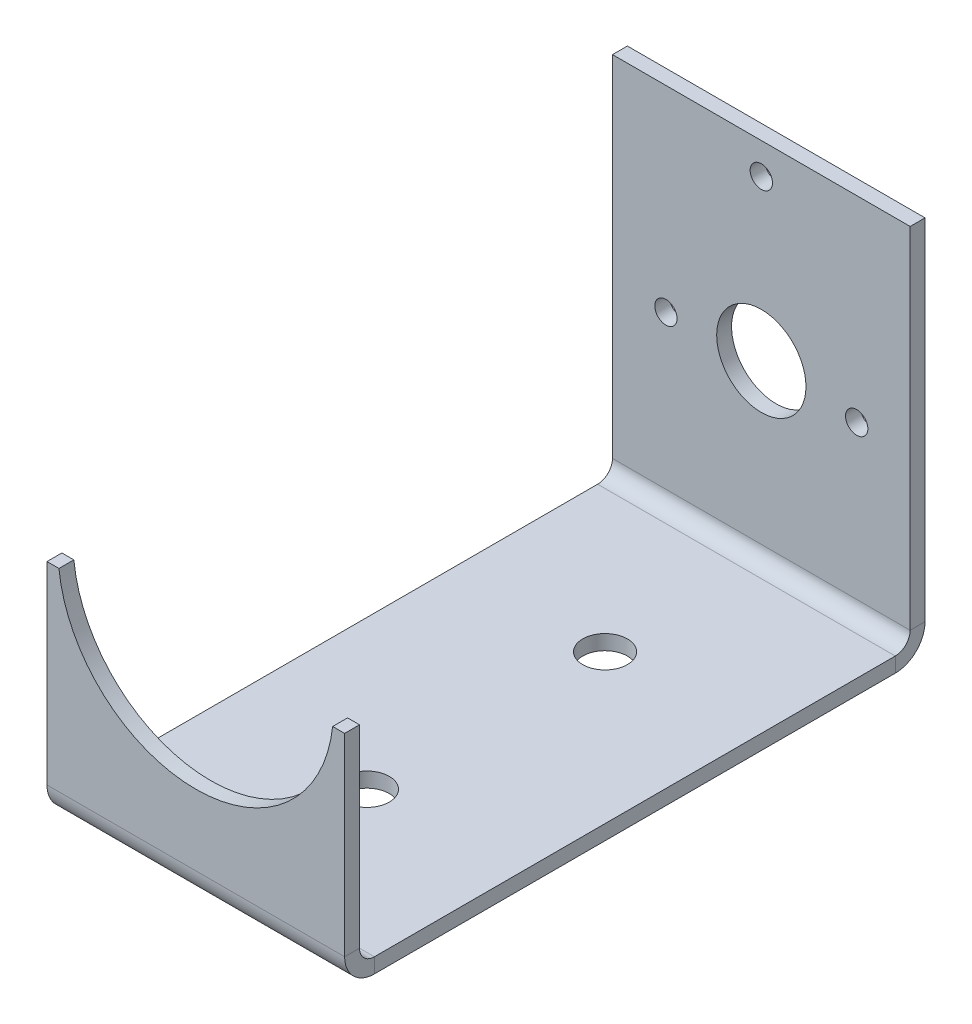
ISO-10303-21;
HEADER;
FILE_DESCRIPTION(('STEP AP214'),'2;1');
FILE_NAME('part.step','',(''),(''),'','','');
FILE_SCHEMA(('AUTOMOTIVE_DESIGN { 1 0 10303 214 1 1 1 1 }'));
ENDSEC;
DATA;
#1=APPLICATION_CONTEXT('core data for automotive mechanical design processes');
#2=APPLICATION_PROTOCOL_DEFINITION('international standard','automotive_design',2000,#1);
#3=PRODUCT_CONTEXT('',#1,'mechanical');
#4=PRODUCT('Part','Part','',(#3));
#5=PRODUCT_RELATED_PRODUCT_CATEGORY('part','',(#4));
#6=PRODUCT_DEFINITION_FORMATION('','',#4);
#7=PRODUCT_DEFINITION_CONTEXT('part definition',#1,'design');
#8=PRODUCT_DEFINITION('design','',#6,#7);
#9=PRODUCT_DEFINITION_SHAPE('','',#8);
#10=(LENGTH_UNIT() NAMED_UNIT(*) SI_UNIT(.MILLI.,.METRE.));
#11=(NAMED_UNIT(*) PLANE_ANGLE_UNIT() SI_UNIT($,.RADIAN.));
#12=(NAMED_UNIT(*) SI_UNIT($,.STERADIAN.) SOLID_ANGLE_UNIT());
#13=UNCERTAINTY_MEASURE_WITH_UNIT(LENGTH_MEASURE(1.E-05),#10,'distance_accuracy_value','');
#14=(GEOMETRIC_REPRESENTATION_CONTEXT(3) GLOBAL_UNCERTAINTY_ASSIGNED_CONTEXT((#13)) GLOBAL_UNIT_ASSIGNED_CONTEXT((#10,
#11,#12)) REPRESENTATION_CONTEXT('',''));
#15=CARTESIAN_POINT('',(0.,0.,0.));
#16=DIRECTION('',(0.,0.,1.));
#17=DIRECTION('',(1.,0.,0.));
#18=AXIS2_PLACEMENT_3D('',#15,#16,#17);
#19=CARTESIAN_POINT('',(-20.,30.,39.));
#20=DIRECTION('',(0.,-1.,0.));
#21=DIRECTION('',(0.,0.,-1.));
#22=AXIS2_PLACEMENT_3D('',#19,#20,#21);
#23=PLANE('',#22);
#24=DIRECTION('',(-1.,0.,0.));
#25=VECTOR('',#24,1.);
#26=CARTESIAN_POINT('',(0.,30.,39.));
#27=LINE('',#26,#25);
#28=CARTESIAN_POINT('',(-18.3915741576464,30.,39.));
#29=VERTEX_POINT('',#28);
#30=CARTESIAN_POINT('',(-20.,30.,39.));
#31=VERTEX_POINT('',#30);
#32=EDGE_CURVE('E255',#29,#31,#27,.T.);
#33=ORIENTED_EDGE('',*,*,#32,.F.);
#34=DIRECTION('',(0.,0.,-1.));
#35=VECTOR('',#34,1.);
#36=CARTESIAN_POINT('',(-18.3915741576464,30.,54.9999999999999));
#37=LINE('',#36,#35);
#38=CARTESIAN_POINT('',(-18.3915741576464,30.,37.));
#39=VERTEX_POINT('',#38);
#40=EDGE_CURVE('E15',#29,#39,#37,.T.);
#41=ORIENTED_EDGE('',*,*,#40,.T.);
#42=DIRECTION('',(1.,0.,0.));
#43=VECTOR('',#42,1.);
#44=CARTESIAN_POINT('',(-20.,30.,37.));
#45=LINE('',#44,#43);
#46=CARTESIAN_POINT('',(-20.,30.,37.));
#47=VERTEX_POINT('',#46);
#48=EDGE_CURVE('E267',#39,#47,#45,.F.);
#49=ORIENTED_EDGE('',*,*,#48,.T.);
#50=DIRECTION('',(0.,0.,-1.));
#51=VECTOR('',#50,1.);
#52=CARTESIAN_POINT('',(-20.,30.,39.));
#53=LINE('',#52,#51);
#54=EDGE_CURVE('E254',#31,#47,#53,.T.);
#55=ORIENTED_EDGE('',*,*,#54,.F.);
#56=EDGE_LOOP('',(#33,#41,#49,#55));
#57=FACE_BOUND('',#56,.T.);
#58=ADVANCED_FACE('F92',(#57),#23,.F.);
#59=CARTESIAN_POINT('',(-20.,2.,-35.));
#60=DIRECTION('',(-1.,0.,0.));
#61=DIRECTION('',(0.,0.,1.));
#62=AXIS2_PLACEMENT_3D('',#59,#60,#61);
#63=PLANE('',#62);
#64=DIRECTION('',(0.,1.,0.));
#65=VECTOR('',#64,1.);
#66=CARTESIAN_POINT('',(-20.,2.,-35.));
#67=LINE('',#66,#65);
#68=CARTESIAN_POINT('',(-20.,0.,-35.));
#69=VERTEX_POINT('',#68);
#70=CARTESIAN_POINT('',(-20.,2.,-35.));
#71=VERTEX_POINT('',#70);
#72=EDGE_CURVE('E167',#69,#71,#67,.T.);
#73=ORIENTED_EDGE('',*,*,#72,.F.);
#74=DIRECTION('',(0.,0.,1.));
#75=VECTOR('',#74,1.);
#76=CARTESIAN_POINT('',(-20.,0.,0.));
#77=LINE('',#76,#75);
#78=CARTESIAN_POINT('',(-20.,0.,35.));
#79=VERTEX_POINT('',#78);
#80=EDGE_CURVE('E138',#69,#79,#77,.T.);
#81=ORIENTED_EDGE('',*,*,#80,.T.);
#82=DIRECTION('',(0.,1.,0.));
#83=VECTOR('',#82,1.);
#84=CARTESIAN_POINT('',(-20.,2.,35.));
#85=LINE('',#84,#83);
#86=CARTESIAN_POINT('',(-20.,2.,35.));
#87=VERTEX_POINT('',#86);
#88=EDGE_CURVE('E169',#79,#87,#85,.T.);
#89=ORIENTED_EDGE('',*,*,#88,.T.);
#90=DIRECTION('',(0.,0.,1.));
#91=VECTOR('',#90,1.);
#92=CARTESIAN_POINT('',(-20.,2.,-35.));
#93=LINE('',#92,#91);
#94=EDGE_CURVE('E158',#71,#87,#93,.T.);
#95=ORIENTED_EDGE('',*,*,#94,.F.);
#96=EDGE_LOOP('',(#73,#81,#89,#95));
#97=FACE_BOUND('',#96,.T.);
#98=ADVANCED_FACE('F94',(#97),#63,.T.);
#99=CARTESIAN_POINT('',(20.,2.,-35.));
#100=DIRECTION('',(1.,0.,0.));
#101=DIRECTION('',(0.,0.,-1.));
#102=AXIS2_PLACEMENT_3D('',#99,#100,#101);
#103=PLANE('',#102);
#104=DIRECTION('',(0.,1.,0.));
#105=VECTOR('',#104,1.);
#106=CARTESIAN_POINT('',(20.,2.,35.));
#107=LINE('',#106,#105);
#108=CARTESIAN_POINT('',(20.,0.,35.));
#109=VERTEX_POINT('',#108);
#110=CARTESIAN_POINT('',(20.,2.,35.));
#111=VERTEX_POINT('',#110);
#112=EDGE_CURVE('E205',#109,#111,#107,.T.);
#113=ORIENTED_EDGE('',*,*,#112,.F.);
#114=DIRECTION('',(0.,0.,1.));
#115=VECTOR('',#114,1.);
#116=CARTESIAN_POINT('',(20.,0.,0.));
#117=LINE('',#116,#115);
#118=CARTESIAN_POINT('',(20.,0.,-35.));
#119=VERTEX_POINT('',#118);
#120=EDGE_CURVE('E198',#109,#119,#117,.F.);
#121=ORIENTED_EDGE('',*,*,#120,.T.);
#122=DIRECTION('',(0.,1.,0.));
#123=VECTOR('',#122,1.);
#124=CARTESIAN_POINT('',(20.,2.,-35.));
#125=LINE('',#124,#123);
#126=CARTESIAN_POINT('',(20.,2.,-35.));
#127=VERTEX_POINT('',#126);
#128=EDGE_CURVE('E197',#119,#127,#125,.T.);
#129=ORIENTED_EDGE('',*,*,#128,.T.);
#130=DIRECTION('',(0.,0.,-1.));
#131=VECTOR('',#130,1.);
#132=CARTESIAN_POINT('',(20.,2.,-35.));
#133=LINE('',#132,#131);
#134=EDGE_CURVE('E116',#111,#127,#133,.T.);
#135=ORIENTED_EDGE('',*,*,#134,.F.);
#136=EDGE_LOOP('',(#113,#121,#129,#135));
#137=FACE_BOUND('',#136,.T.);
#138=ADVANCED_FACE('F427',(#137),#103,.T.);
#139=CARTESIAN_POINT('',(0.,2.,0.));
#140=DIRECTION('',(0.,1.,0.));
#141=DIRECTION('',(0.,0.,1.));
#142=AXIS2_PLACEMENT_3D('',#139,#140,#141);
#143=PLANE('',#142);
#144=CARTESIAN_POINT('',(0.,2.,-16.));
#145=DIRECTION('',(0.,1.,0.));
#146=DIRECTION('',(0.,0.,1.));
#147=AXIS2_PLACEMENT_3D('',#144,#145,#146);
#148=CIRCLE('',#147,3.);
#149=CARTESIAN_POINT('',(0.,2.,-13.));
#150=VERTEX_POINT('',#149);
#151=EDGE_CURVE('E228',#150,#150,#148,.T.);
#152=ORIENTED_EDGE('',*,*,#151,.F.);
#153=EDGE_LOOP('',(#152));
#154=FACE_BOUND('',#153,.T.);
#155=CARTESIAN_POINT('',(0.,2.,16.));
#156=DIRECTION('',(0.,1.,0.));
#157=DIRECTION('',(0.,0.,1.));
#158=AXIS2_PLACEMENT_3D('',#155,#156,#157);
#159=CIRCLE('',#158,3.);
#160=CARTESIAN_POINT('',(0.,2.,19.));
#161=VERTEX_POINT('',#160);
#162=EDGE_CURVE('E289',#161,#161,#159,.T.);
#163=ORIENTED_EDGE('',*,*,#162,.F.);
#164=EDGE_LOOP('',(#163));
#165=FACE_BOUND('',#164,.T.);
#166=ORIENTED_EDGE('',*,*,#134,.T.);
#167=DIRECTION('',(-1.,0.,0.));
#168=VECTOR('',#167,1.);
#169=CARTESIAN_POINT('',(-20.,2.,-35.));
#170=LINE('',#169,#168);
#171=EDGE_CURVE('E155',#127,#71,#170,.T.);
#172=ORIENTED_EDGE('',*,*,#171,.T.);
#173=ORIENTED_EDGE('',*,*,#94,.T.);
#174=DIRECTION('',(1.,0.,0.));
#175=VECTOR('',#174,1.);
#176=CARTESIAN_POINT('',(-20.,2.,35.));
#177=LINE('',#176,#175);
#178=EDGE_CURVE('E170',#87,#111,#177,.T.);
#179=ORIENTED_EDGE('',*,*,#178,.T.);
#180=EDGE_LOOP('',(#166,#172,#173,#179));
#181=FACE_BOUND('',#180,.T.);
#182=ADVANCED_FACE('F157',(#154,#165,#181),#143,.T.);
#183=CARTESIAN_POINT('',(0.,0.,0.));
#184=DIRECTION('',(0.,1.,0.));
#185=DIRECTION('',(0.,0.,1.));
#186=AXIS2_PLACEMENT_3D('',#183,#184,#185);
#187=PLANE('',#186);
#188=CARTESIAN_POINT('',(0.,0.,-16.));
#189=DIRECTION('',(0.,1.,0.));
#190=DIRECTION('',(0.,0.,1.));
#191=AXIS2_PLACEMENT_3D('',#188,#189,#190);
#192=CIRCLE('',#191,3.);
#193=CARTESIAN_POINT('',(0.,0.,-13.));
#194=VERTEX_POINT('',#193);
#195=EDGE_CURVE('E227',#194,#194,#192,.T.);
#196=ORIENTED_EDGE('',*,*,#195,.T.);
#197=EDGE_LOOP('',(#196));
#198=FACE_BOUND('',#197,.T.);
#199=CARTESIAN_POINT('',(0.,0.,16.));
#200=DIRECTION('',(0.,1.,0.));
#201=DIRECTION('',(0.,0.,1.));
#202=AXIS2_PLACEMENT_3D('',#199,#200,#201);
#203=CIRCLE('',#202,3.);
#204=CARTESIAN_POINT('',(0.,0.,19.));
#205=VERTEX_POINT('',#204);
#206=EDGE_CURVE('E224',#205,#205,#203,.T.);
#207=ORIENTED_EDGE('',*,*,#206,.T.);
#208=EDGE_LOOP('',(#207));
#209=FACE_BOUND('',#208,.T.);
#210=ORIENTED_EDGE('',*,*,#120,.F.);
#211=DIRECTION('',(1.,0.,0.));
#212=VECTOR('',#211,1.);
#213=CARTESIAN_POINT('',(0.,0.,35.));
#214=LINE('',#213,#212);
#215=EDGE_CURVE('E194',#79,#109,#214,.T.);
#216=ORIENTED_EDGE('',*,*,#215,.F.);
#217=ORIENTED_EDGE('',*,*,#80,.F.);
#218=DIRECTION('',(1.,0.,0.));
#219=VECTOR('',#218,1.);
#220=CARTESIAN_POINT('',(0.,0.,-35.));
#221=LINE('',#220,#219);
#222=EDGE_CURVE('E133',#119,#69,#221,.F.);
#223=ORIENTED_EDGE('',*,*,#222,.F.);
#224=EDGE_LOOP('',(#210,#216,#217,#223));
#225=FACE_BOUND('',#224,.T.);
#226=ADVANCED_FACE('F426',(#198,#209,#225),#187,.F.);
#227=CARTESIAN_POINT('',(20.,3.99999999999998,-35.));
#228=DIRECTION('',(1.,0.,0.));
#229=DIRECTION('',(0.,0.,-1.));
#230=AXIS2_PLACEMENT_3D('',#227,#228,#229);
#231=PLANE('',#230);
#232=DIRECTION('',(0.,0.,1.));
#233=VECTOR('',#232,1.);
#234=CARTESIAN_POINT('',(20.,4.00000000000001,-39.));
#235=LINE('',#234,#233);
#236=CARTESIAN_POINT('',(20.,3.99999999999998,-37.));
#237=VERTEX_POINT('',#236);
#238=CARTESIAN_POINT('',(20.,3.99999999999997,-39.));
#239=VERTEX_POINT('',#238);
#240=EDGE_CURVE('E223',#237,#239,#235,.F.);
#241=ORIENTED_EDGE('',*,*,#240,.F.);
#242=CARTESIAN_POINT('',(20.,3.99999999999998,-35.));
#243=DIRECTION('',(-1.,0.,0.));
#244=DIRECTION('',(0.,0.,1.));
#245=AXIS2_PLACEMENT_3D('',#242,#243,#244);
#246=CIRCLE('',#245,2.);
#247=EDGE_CURVE('E185',#127,#237,#246,.F.);
#248=ORIENTED_EDGE('',*,*,#247,.F.);
#249=ORIENTED_EDGE('',*,*,#128,.F.);
#250=CARTESIAN_POINT('',(20.,3.99999999999998,-35.));
#251=DIRECTION('',(-1.,0.,0.));
#252=DIRECTION('',(0.,0.,1.));
#253=AXIS2_PLACEMENT_3D('',#250,#251,#252);
#254=CIRCLE('',#253,4.);
#255=EDGE_CURVE('E200',#119,#239,#254,.F.);
#256=ORIENTED_EDGE('',*,*,#255,.T.);
#257=EDGE_LOOP('',(#241,#248,#249,#256));
#258=FACE_BOUND('',#257,.T.);
#259=ADVANCED_FACE('F344',(#258),#231,.T.);
#260=CARTESIAN_POINT('',(-20.,3.99999999999998,-35.));
#261=DIRECTION('',(1.,0.,0.));
#262=DIRECTION('',(0.,0.,-1.));
#263=AXIS2_PLACEMENT_3D('',#260,#261,#262);
#264=PLANE('',#263);
#265=CARTESIAN_POINT('',(-20.,3.99999999999998,-35.));
#266=DIRECTION('',(-1.,0.,0.));
#267=DIRECTION('',(0.,0.,1.));
#268=AXIS2_PLACEMENT_3D('',#265,#266,#267);
#269=CIRCLE('',#268,2.);
#270=CARTESIAN_POINT('',(-20.,3.99999999999998,-37.));
#271=VERTEX_POINT('',#270);
#272=EDGE_CURVE('E177',#271,#71,#269,.T.);
#273=ORIENTED_EDGE('',*,*,#272,.F.);
#274=DIRECTION('',(0.,0.,1.));
#275=VECTOR('',#274,1.);
#276=CARTESIAN_POINT('',(-20.,4.,-37.));
#277=LINE('',#276,#275);
#278=CARTESIAN_POINT('',(-20.,4.00000000000001,-39.));
#279=VERTEX_POINT('',#278);
#280=EDGE_CURVE('E335',#271,#279,#277,.F.);
#281=ORIENTED_EDGE('',*,*,#280,.T.);
#282=CARTESIAN_POINT('',(-20.,3.99999999999998,-35.));
#283=DIRECTION('',(-1.,0.,0.));
#284=DIRECTION('',(0.,0.,1.));
#285=AXIS2_PLACEMENT_3D('',#282,#283,#284);
#286=CIRCLE('',#285,4.);
#287=EDGE_CURVE('E180',#279,#69,#286,.T.);
#288=ORIENTED_EDGE('',*,*,#287,.T.);
#289=ORIENTED_EDGE('',*,*,#72,.T.);
#290=EDGE_LOOP('',(#273,#281,#288,#289));
#291=FACE_BOUND('',#290,.T.);
#292=ADVANCED_FACE('F175',(#291),#264,.F.);
#293=CARTESIAN_POINT('',(-20.,3.99999999999998,-35.));
#294=DIRECTION('',(-1.,0.,0.));
#295=DIRECTION('',(0.,0.,-1.));
#296=AXIS2_PLACEMENT_3D('',#293,#294,#295);
#297=CYLINDRICAL_SURFACE('',#296,4.);
#298=ORIENTED_EDGE('',*,*,#222,.T.);
#299=ORIENTED_EDGE('',*,*,#287,.F.);
#300=DIRECTION('',(-1.,0.,0.));
#301=VECTOR('',#300,1.);
#302=CARTESIAN_POINT('',(20.,4.00000000000001,-39.));
#303=LINE('',#302,#301);
#304=EDGE_CURVE('E333',#279,#239,#303,.F.);
#305=ORIENTED_EDGE('',*,*,#304,.T.);
#306=ORIENTED_EDGE('',*,*,#255,.F.);
#307=EDGE_LOOP('',(#298,#299,#305,#306));
#308=FACE_BOUND('',#307,.T.);
#309=ADVANCED_FACE('F504',(#308),#297,.T.);
#310=CARTESIAN_POINT('',(-20.,3.99999999999998,-35.));
#311=DIRECTION('',(-1.,0.,0.));
#312=DIRECTION('',(0.,0.,-1.));
#313=AXIS2_PLACEMENT_3D('',#310,#311,#312);
#314=CYLINDRICAL_SURFACE('',#313,2.);
#315=ORIENTED_EDGE('',*,*,#171,.F.);
#316=ORIENTED_EDGE('',*,*,#247,.T.);
#317=DIRECTION('',(-1.,0.,0.));
#318=VECTOR('',#317,1.);
#319=CARTESIAN_POINT('',(20.,4.,-37.));
#320=LINE('',#319,#318);
#321=EDGE_CURVE('E184',#237,#271,#320,.T.);
#322=ORIENTED_EDGE('',*,*,#321,.T.);
#323=ORIENTED_EDGE('',*,*,#272,.T.);
#324=EDGE_LOOP('',(#315,#316,#322,#323));
#325=FACE_BOUND('',#324,.T.);
#326=ADVANCED_FACE('F182',(#325),#314,.F.);
#327=CARTESIAN_POINT('',(20.,1.99999999999999,-39.));
#328=DIRECTION('',(-1.,0.,0.));
#329=DIRECTION('',(0.,0.,1.));
#330=AXIS2_PLACEMENT_3D('',#327,#328,#329);
#331=PLANE('',#330);
#332=ORIENTED_EDGE('',*,*,#240,.T.);
#333=DIRECTION('',(0.,-1.,0.));
#334=VECTOR('',#333,1.);
#335=CARTESIAN_POINT('',(20.,-1.30891782390315E-13,-39.));
#336=LINE('',#335,#334);
#337=CARTESIAN_POINT('',(20.,51.,-39.0000000000002));
#338=VERTEX_POINT('',#337);
#339=EDGE_CURVE('E321',#338,#239,#336,.T.);
#340=ORIENTED_EDGE('',*,*,#339,.F.);
#341=DIRECTION('',(0.,0.,1.));
#342=VECTOR('',#341,1.);
#343=CARTESIAN_POINT('',(20.,51.,-39.0000000000002));
#344=LINE('',#343,#342);
#345=CARTESIAN_POINT('',(20.,51.,-37.0000000000002));
#346=VERTEX_POINT('',#345);
#347=EDGE_CURVE('E190',#338,#346,#344,.T.);
#348=ORIENTED_EDGE('',*,*,#347,.T.);
#349=DIRECTION('',(0.,1.,0.));
#350=VECTOR('',#349,1.);
#351=CARTESIAN_POINT('',(20.,2.,-37.));
#352=LINE('',#351,#350);
#353=EDGE_CURVE('E330',#346,#237,#352,.F.);
#354=ORIENTED_EDGE('',*,*,#353,.T.);
#355=EDGE_LOOP('',(#332,#340,#348,#354));
#356=FACE_BOUND('',#355,.T.);
#357=ADVANCED_FACE('F348',(#356),#331,.F.);
#358=CARTESIAN_POINT('',(-20.,51.,-39.0000000000002));
#359=DIRECTION('',(1.,0.,0.));
#360=DIRECTION('',(0.,0.,-1.));
#361=AXIS2_PLACEMENT_3D('',#358,#359,#360);
#362=PLANE('',#361);
#363=ORIENTED_EDGE('',*,*,#280,.F.);
#364=DIRECTION('',(0.,-1.,0.));
#365=VECTOR('',#364,1.);
#366=CARTESIAN_POINT('',(-20.,51.,-37.0000000000002));
#367=LINE('',#366,#365);
#368=CARTESIAN_POINT('',(-20.,51.,-37.0000000000002));
#369=VERTEX_POINT('',#368);
#370=EDGE_CURVE('E327',#271,#369,#367,.F.);
#371=ORIENTED_EDGE('',*,*,#370,.T.);
#372=DIRECTION('',(0.,0.,1.));
#373=VECTOR('',#372,1.);
#374=CARTESIAN_POINT('',(-20.,51.,-39.0000000000002));
#375=LINE('',#374,#373);
#376=CARTESIAN_POINT('',(-20.,51.,-39.0000000000002));
#377=VERTEX_POINT('',#376);
#378=EDGE_CURVE('E186',#377,#369,#375,.T.);
#379=ORIENTED_EDGE('',*,*,#378,.F.);
#380=DIRECTION('',(0.,1.,0.));
#381=VECTOR('',#380,1.);
#382=CARTESIAN_POINT('',(-20.,-1.30891782390315E-13,-39.));
#383=LINE('',#382,#381);
#384=EDGE_CURVE('E318',#279,#377,#383,.T.);
#385=ORIENTED_EDGE('',*,*,#384,.F.);
#386=EDGE_LOOP('',(#363,#371,#379,#385));
#387=FACE_BOUND('',#386,.T.);
#388=ADVANCED_FACE('F370',(#387),#362,.F.);
#389=CARTESIAN_POINT('',(0.,-1.30891782390315E-13,-39.));
#390=DIRECTION('',(0.,0.,1.));
#391=DIRECTION('',(0.,-1.,0.));
#392=AXIS2_PLACEMENT_3D('',#389,#390,#391);
#393=PLANE('',#392);
#394=CARTESIAN_POINT('',(-12.8178141423564,24.5996315544879,-39.0000000000001));
#395=DIRECTION('',(0.,0.,-1.));
#396=DIRECTION('',(0.,1.,0.));
#397=AXIS2_PLACEMENT_3D('',#394,#395,#396);
#398=CIRCLE('',#397,1.5);
#399=CARTESIAN_POINT('',(-12.8178141423564,26.0996315544879,-39.0000000000001));
#400=VERTEX_POINT('',#399);
#401=EDGE_CURVE('E230',#400,#400,#398,.T.);
#402=ORIENTED_EDGE('',*,*,#401,.F.);
#403=EDGE_LOOP('',(#402));
#404=FACE_BOUND('',#403,.T.);
#405=CARTESIAN_POINT('',(12.8178141423564,24.599631554488,-39.0000000000001));
#406=DIRECTION('',(0.,0.,-1.));
#407=DIRECTION('',(0.,1.,0.));
#408=AXIS2_PLACEMENT_3D('',#405,#406,#407);
#409=CIRCLE('',#408,1.5);
#410=CARTESIAN_POINT('',(12.8178141423564,26.099631554488,-39.0000000000001));
#411=VERTEX_POINT('',#410);
#412=EDGE_CURVE('E306',#411,#411,#409,.T.);
#413=ORIENTED_EDGE('',*,*,#412,.F.);
#414=EDGE_LOOP('',(#413));
#415=FACE_BOUND('',#414,.T.);
#416=CARTESIAN_POINT('',(0.,46.8007368910241,-39.0000000000001));
#417=DIRECTION('',(0.,0.,-1.));
#418=DIRECTION('',(0.,1.,0.));
#419=AXIS2_PLACEMENT_3D('',#416,#417,#418);
#420=CIRCLE('',#419,1.5);
#421=CARTESIAN_POINT('',(0.,48.3007368910241,-39.0000000000002));
#422=VERTEX_POINT('',#421);
#423=EDGE_CURVE('E303',#422,#422,#420,.T.);
#424=ORIENTED_EDGE('',*,*,#423,.F.);
#425=EDGE_LOOP('',(#424));
#426=FACE_BOUND('',#425,.T.);
#427=CARTESIAN_POINT('',(0.,25.3470008107152,-39.0000000000001));
#428=DIRECTION('',(0.,0.,-1.));
#429=DIRECTION('',(0.,1.,0.));
#430=AXIS2_PLACEMENT_3D('',#427,#428,#429);
#431=CIRCLE('',#430,6.);
#432=CARTESIAN_POINT('',(0.,31.3470008107152,-39.0000000000001));
#433=VERTEX_POINT('',#432);
#434=EDGE_CURVE('E214',#433,#433,#431,.T.);
#435=ORIENTED_EDGE('',*,*,#434,.F.);
#436=EDGE_LOOP('',(#435));
#437=FACE_BOUND('',#436,.T.);
#438=ORIENTED_EDGE('',*,*,#304,.F.);
#439=ORIENTED_EDGE('',*,*,#384,.T.);
#440=DIRECTION('',(1.,0.,0.));
#441=VECTOR('',#440,1.);
#442=CARTESIAN_POINT('',(0.,51.,-39.0000000000002));
#443=LINE('',#442,#441);
#444=EDGE_CURVE('E315',#377,#338,#443,.T.);
#445=ORIENTED_EDGE('',*,*,#444,.T.);
#446=ORIENTED_EDGE('',*,*,#339,.T.);
#447=EDGE_LOOP('',(#438,#439,#445,#446));
#448=FACE_BOUND('',#447,.T.);
#449=ADVANCED_FACE('F352',(#404,#415,#426,#437,#448),#393,.F.);
#450=CARTESIAN_POINT('',(0.,-1.23908819712629E-13,-37.));
#451=DIRECTION('',(0.,0.,1.));
#452=DIRECTION('',(0.,-1.,0.));
#453=AXIS2_PLACEMENT_3D('',#450,#451,#452);
#454=PLANE('',#453);
#455=CARTESIAN_POINT('',(-12.8178141423564,24.5996315544879,-37.0000000000001));
#456=DIRECTION('',(0.,0.,1.));
#457=DIRECTION('',(0.,-1.,0.));
#458=AXIS2_PLACEMENT_3D('',#455,#456,#457);
#459=CIRCLE('',#458,1.5);
#460=CARTESIAN_POINT('',(-12.8178141423564,23.0996315544879,-37.0000000000001));
#461=VERTEX_POINT('',#460);
#462=EDGE_CURVE('E220',#461,#461,#459,.T.);
#463=ORIENTED_EDGE('',*,*,#462,.F.);
#464=EDGE_LOOP('',(#463));
#465=FACE_BOUND('',#464,.T.);
#466=CARTESIAN_POINT('',(12.8178141423564,24.599631554488,-37.0000000000001));
#467=DIRECTION('',(0.,0.,1.));
#468=DIRECTION('',(0.,-1.,0.));
#469=AXIS2_PLACEMENT_3D('',#466,#467,#468);
#470=CIRCLE('',#469,1.5);
#471=CARTESIAN_POINT('',(12.8178141423564,23.099631554488,-37.0000000000001));
#472=VERTEX_POINT('',#471);
#473=EDGE_CURVE('E217',#472,#472,#470,.T.);
#474=ORIENTED_EDGE('',*,*,#473,.F.);
#475=EDGE_LOOP('',(#474));
#476=FACE_BOUND('',#475,.T.);
#477=CARTESIAN_POINT('',(0.,46.8007368910241,-37.0000000000002));
#478=DIRECTION('',(0.,0.,1.));
#479=DIRECTION('',(0.,-1.,0.));
#480=AXIS2_PLACEMENT_3D('',#477,#478,#479);
#481=CIRCLE('',#480,1.5);
#482=CARTESIAN_POINT('',(0.,45.3007368910241,-37.0000000000001));
#483=VERTEX_POINT('',#482);
#484=EDGE_CURVE('E213',#483,#483,#481,.T.);
#485=ORIENTED_EDGE('',*,*,#484,.F.);
#486=EDGE_LOOP('',(#485));
#487=FACE_BOUND('',#486,.T.);
#488=CARTESIAN_POINT('',(0.,25.3470008107152,-37.0000000000001));
#489=DIRECTION('',(0.,0.,1.));
#490=DIRECTION('',(0.,-1.,0.));
#491=AXIS2_PLACEMENT_3D('',#488,#489,#490);
#492=CIRCLE('',#491,6.);
#493=CARTESIAN_POINT('',(0.,19.3470008107152,-37.0000000000001));
#494=VERTEX_POINT('',#493);
#495=EDGE_CURVE('E210',#494,#494,#492,.T.);
#496=ORIENTED_EDGE('',*,*,#495,.F.);
#497=EDGE_LOOP('',(#496));
#498=FACE_BOUND('',#497,.T.);
#499=ORIENTED_EDGE('',*,*,#370,.F.);
#500=ORIENTED_EDGE('',*,*,#321,.F.);
#501=ORIENTED_EDGE('',*,*,#353,.F.);
#502=DIRECTION('',(-1.,0.,0.));
#503=VECTOR('',#502,1.);
#504=CARTESIAN_POINT('',(20.,51.,-37.0000000000002));
#505=LINE('',#504,#503);
#506=EDGE_CURVE('E324',#369,#346,#505,.F.);
#507=ORIENTED_EDGE('',*,*,#506,.F.);
#508=EDGE_LOOP('',(#499,#500,#501,#507));
#509=FACE_BOUND('',#508,.T.);
#510=ADVANCED_FACE('F368',(#465,#476,#487,#498,#509),#454,.T.);
#511=CARTESIAN_POINT('',(20.,51.,-39.0000000000002));
#512=DIRECTION('',(0.,-1.,0.));
#513=DIRECTION('',(0.,0.,-1.));
#514=AXIS2_PLACEMENT_3D('',#511,#512,#513);
#515=PLANE('',#514);
#516=ORIENTED_EDGE('',*,*,#506,.T.);
#517=ORIENTED_EDGE('',*,*,#347,.F.);
#518=ORIENTED_EDGE('',*,*,#444,.F.);
#519=ORIENTED_EDGE('',*,*,#378,.T.);
#520=EDGE_LOOP('',(#516,#517,#518,#519));
#521=FACE_BOUND('',#520,.T.);
#522=ADVANCED_FACE('F361',(#521),#515,.F.);
#523=CARTESIAN_POINT('',(0.,25.3470008107153,-14.0000000000001));
#524=DIRECTION('',(0.,0.,-1.));
#525=DIRECTION('',(0.,1.,0.));
#526=AXIS2_PLACEMENT_3D('',#523,#524,#525);
#527=CYLINDRICAL_SURFACE('',#526,6.);
#528=ORIENTED_EDGE('',*,*,#495,.T.);
#529=EDGE_LOOP('',(#528));
#530=FACE_BOUND('',#529,.T.);
#531=ORIENTED_EDGE('',*,*,#434,.T.);
#532=EDGE_LOOP('',(#531));
#533=FACE_BOUND('',#532,.T.);
#534=ADVANCED_FACE('F481',(#530,#533),#527,.F.);
#535=CARTESIAN_POINT('',(0.,46.8007368910242,-14.0000000000001));
#536=DIRECTION('',(0.,0.,-1.));
#537=DIRECTION('',(0.,1.,0.));
#538=AXIS2_PLACEMENT_3D('',#535,#536,#537);
#539=CYLINDRICAL_SURFACE('',#538,1.5);
#540=ORIENTED_EDGE('',*,*,#484,.T.);
#541=EDGE_LOOP('',(#540));
#542=FACE_BOUND('',#541,.T.);
#543=ORIENTED_EDGE('',*,*,#423,.T.);
#544=EDGE_LOOP('',(#543));
#545=FACE_BOUND('',#544,.T.);
#546=ADVANCED_FACE('F477',(#542,#545),#539,.F.);
#547=CARTESIAN_POINT('',(12.8178141423564,24.5996315544881,-14.0000000000001));
#548=DIRECTION('',(0.,0.,-1.));
#549=DIRECTION('',(0.,1.,0.));
#550=AXIS2_PLACEMENT_3D('',#547,#548,#549);
#551=CYLINDRICAL_SURFACE('',#550,1.5);
#552=ORIENTED_EDGE('',*,*,#473,.T.);
#553=EDGE_LOOP('',(#552));
#554=FACE_BOUND('',#553,.T.);
#555=ORIENTED_EDGE('',*,*,#412,.T.);
#556=EDGE_LOOP('',(#555));
#557=FACE_BOUND('',#556,.T.);
#558=ADVANCED_FACE('F480',(#554,#557),#551,.F.);
#559=CARTESIAN_POINT('',(-12.8178141423564,24.599631554488,-14.0000000000001));
#560=DIRECTION('',(0.,0.,-1.));
#561=DIRECTION('',(0.,1.,0.));
#562=AXIS2_PLACEMENT_3D('',#559,#560,#561);
#563=CYLINDRICAL_SURFACE('',#562,1.5);
#564=ORIENTED_EDGE('',*,*,#462,.T.);
#565=EDGE_LOOP('',(#564));
#566=FACE_BOUND('',#565,.T.);
#567=ORIENTED_EDGE('',*,*,#401,.T.);
#568=EDGE_LOOP('',(#567));
#569=FACE_BOUND('',#568,.T.);
#570=ADVANCED_FACE('F475',(#566,#569),#563,.F.);
#571=CARTESIAN_POINT('',(0.,-9.,16.));
#572=DIRECTION('',(0.,1.,0.));
#573=DIRECTION('',(0.,0.,1.));
#574=AXIS2_PLACEMENT_3D('',#571,#572,#573);
#575=CYLINDRICAL_SURFACE('',#574,3.);
#576=ORIENTED_EDGE('',*,*,#162,.T.);
#577=EDGE_LOOP('',(#576));
#578=FACE_BOUND('',#577,.T.);
#579=ORIENTED_EDGE('',*,*,#206,.F.);
#580=EDGE_LOOP('',(#579));
#581=FACE_BOUND('',#580,.T.);
#582=ADVANCED_FACE('F471',(#578,#581),#575,.F.);
#583=CARTESIAN_POINT('',(0.,-9.,-16.));
#584=DIRECTION('',(0.,1.,0.));
#585=DIRECTION('',(0.,0.,1.));
#586=AXIS2_PLACEMENT_3D('',#583,#584,#585);
#587=CYLINDRICAL_SURFACE('',#586,3.);
#588=ORIENTED_EDGE('',*,*,#151,.T.);
#589=EDGE_LOOP('',(#588));
#590=FACE_BOUND('',#589,.T.);
#591=ORIENTED_EDGE('',*,*,#195,.F.);
#592=EDGE_LOOP('',(#591));
#593=FACE_BOUND('',#592,.T.);
#594=ADVANCED_FACE('F466',(#590,#593),#587,.F.);
#595=CARTESIAN_POINT('',(-20.,4.,35.));
#596=DIRECTION('',(-1.,0.,0.));
#597=DIRECTION('',(0.,0.,1.));
#598=AXIS2_PLACEMENT_3D('',#595,#596,#597);
#599=PLANE('',#598);
#600=DIRECTION('',(0.,0.,-1.));
#601=VECTOR('',#600,1.);
#602=CARTESIAN_POINT('',(-20.,4.,39.));
#603=LINE('',#602,#601);
#604=CARTESIAN_POINT('',(-20.,4.,37.));
#605=VERTEX_POINT('',#604);
#606=CARTESIAN_POINT('',(-20.,4.,39.));
#607=VERTEX_POINT('',#606);
#608=EDGE_CURVE('E283',#605,#607,#603,.F.);
#609=ORIENTED_EDGE('',*,*,#608,.F.);
#610=CARTESIAN_POINT('',(-20.,4.,35.));
#611=DIRECTION('',(1.,0.,0.));
#612=DIRECTION('',(0.,0.,-1.));
#613=AXIS2_PLACEMENT_3D('',#610,#611,#612);
#614=CIRCLE('',#613,2.);
#615=EDGE_CURVE('E293',#87,#605,#614,.F.);
#616=ORIENTED_EDGE('',*,*,#615,.F.);
#617=ORIENTED_EDGE('',*,*,#88,.F.);
#618=CARTESIAN_POINT('',(-20.,4.,35.));
#619=DIRECTION('',(1.,0.,0.));
#620=DIRECTION('',(0.,0.,-1.));
#621=AXIS2_PLACEMENT_3D('',#618,#619,#620);
#622=CIRCLE('',#621,4.);
#623=EDGE_CURVE('E286',#79,#607,#622,.F.);
#624=ORIENTED_EDGE('',*,*,#623,.T.);
#625=EDGE_LOOP('',(#609,#616,#617,#624));
#626=FACE_BOUND('',#625,.T.);
#627=ADVANCED_FACE('F424',(#626),#599,.T.);
#628=CARTESIAN_POINT('',(20.,4.,35.));
#629=DIRECTION('',(-1.,0.,0.));
#630=DIRECTION('',(0.,0.,1.));
#631=AXIS2_PLACEMENT_3D('',#628,#629,#630);
#632=PLANE('',#631);
#633=CARTESIAN_POINT('',(20.,4.,35.));
#634=DIRECTION('',(1.,0.,0.));
#635=DIRECTION('',(0.,0.,-1.));
#636=AXIS2_PLACEMENT_3D('',#633,#634,#635);
#637=CIRCLE('',#636,2.);
#638=CARTESIAN_POINT('',(20.,4.,37.));
#639=VERTEX_POINT('',#638);
#640=EDGE_CURVE('E296',#639,#111,#637,.T.);
#641=ORIENTED_EDGE('',*,*,#640,.F.);
#642=DIRECTION('',(0.,0.,-1.));
#643=VECTOR('',#642,1.);
#644=CARTESIAN_POINT('',(20.,4.,37.));
#645=LINE('',#644,#643);
#646=CARTESIAN_POINT('',(20.,4.,39.));
#647=VERTEX_POINT('',#646);
#648=EDGE_CURVE('E277',#639,#647,#645,.F.);
#649=ORIENTED_EDGE('',*,*,#648,.T.);
#650=CARTESIAN_POINT('',(20.,4.,35.));
#651=DIRECTION('',(1.,0.,0.));
#652=DIRECTION('',(0.,0.,-1.));
#653=AXIS2_PLACEMENT_3D('',#650,#651,#652);
#654=CIRCLE('',#653,4.);
#655=EDGE_CURVE('E290',#647,#109,#654,.T.);
#656=ORIENTED_EDGE('',*,*,#655,.T.);
#657=ORIENTED_EDGE('',*,*,#112,.T.);
#658=EDGE_LOOP('',(#641,#649,#656,#657));
#659=FACE_BOUND('',#658,.T.);
#660=ADVANCED_FACE('F419',(#659),#632,.F.);
#661=CARTESIAN_POINT('',(20.,4.,35.));
#662=DIRECTION('',(1.,0.,0.));
#663=DIRECTION('',(0.,0.,1.));
#664=AXIS2_PLACEMENT_3D('',#661,#662,#663);
#665=CYLINDRICAL_SURFACE('',#664,4.);
#666=ORIENTED_EDGE('',*,*,#215,.T.);
#667=ORIENTED_EDGE('',*,*,#655,.F.);
#668=DIRECTION('',(1.,0.,0.));
#669=VECTOR('',#668,1.);
#670=CARTESIAN_POINT('',(-20.,4.,39.));
#671=LINE('',#670,#669);
#672=EDGE_CURVE('E274',#647,#607,#671,.F.);
#673=ORIENTED_EDGE('',*,*,#672,.T.);
#674=ORIENTED_EDGE('',*,*,#623,.F.);
#675=EDGE_LOOP('',(#666,#667,#673,#674));
#676=FACE_BOUND('',#675,.T.);
#677=ADVANCED_FACE('F425',(#676),#665,.T.);
#678=CARTESIAN_POINT('',(20.,4.,35.));
#679=DIRECTION('',(1.,0.,0.));
#680=DIRECTION('',(0.,0.,1.));
#681=AXIS2_PLACEMENT_3D('',#678,#679,#680);
#682=CYLINDRICAL_SURFACE('',#681,2.);
#683=ORIENTED_EDGE('',*,*,#178,.F.);
#684=ORIENTED_EDGE('',*,*,#615,.T.);
#685=DIRECTION('',(1.,0.,0.));
#686=VECTOR('',#685,1.);
#687=CARTESIAN_POINT('',(-20.,4.,37.));
#688=LINE('',#687,#686);
#689=EDGE_CURVE('E280',#605,#639,#688,.T.);
#690=ORIENTED_EDGE('',*,*,#689,.T.);
#691=ORIENTED_EDGE('',*,*,#640,.T.);
#692=EDGE_LOOP('',(#683,#684,#690,#691));
#693=FACE_BOUND('',#692,.T.);
#694=ADVANCED_FACE('F421',(#693),#682,.F.);
#695=CARTESIAN_POINT('',(-20.,2.,39.));
#696=DIRECTION('',(1.,0.,0.));
#697=DIRECTION('',(0.,0.,-1.));
#698=AXIS2_PLACEMENT_3D('',#695,#696,#697);
#699=PLANE('',#698);
#700=ORIENTED_EDGE('',*,*,#608,.T.);
#701=DIRECTION('',(0.,-1.,0.));
#702=VECTOR('',#701,1.);
#703=CARTESIAN_POINT('',(-20.,0.,39.));
#704=LINE('',#703,#702);
#705=EDGE_CURVE('E263',#31,#607,#704,.T.);
#706=ORIENTED_EDGE('',*,*,#705,.F.);
#707=ORIENTED_EDGE('',*,*,#54,.T.);
#708=DIRECTION('',(0.,1.,0.));
#709=VECTOR('',#708,1.);
#710=CARTESIAN_POINT('',(-20.,2.,37.));
#711=LINE('',#710,#709);
#712=EDGE_CURVE('E271',#47,#605,#711,.F.);
#713=ORIENTED_EDGE('',*,*,#712,.T.);
#714=EDGE_LOOP('',(#700,#706,#707,#713));
#715=FACE_BOUND('',#714,.T.);
#716=ADVANCED_FACE('F409',(#715),#699,.F.);
#717=CARTESIAN_POINT('',(20.,30.,39.));
#718=DIRECTION('',(-1.,0.,0.));
#719=DIRECTION('',(0.,0.,1.));
#720=AXIS2_PLACEMENT_3D('',#717,#718,#719);
#721=PLANE('',#720);
#722=ORIENTED_EDGE('',*,*,#648,.F.);
#723=DIRECTION('',(0.,-1.,0.));
#724=VECTOR('',#723,1.);
#725=CARTESIAN_POINT('',(20.,30.,37.));
#726=LINE('',#725,#724);
#727=CARTESIAN_POINT('',(20.,30.,37.));
#728=VERTEX_POINT('',#727);
#729=EDGE_CURVE('E268',#639,#728,#726,.F.);
#730=ORIENTED_EDGE('',*,*,#729,.T.);
#731=DIRECTION('',(0.,0.,-1.));
#732=VECTOR('',#731,1.);
#733=CARTESIAN_POINT('',(20.,30.,39.));
#734=LINE('',#733,#732);
#735=CARTESIAN_POINT('',(20.,30.,39.));
#736=VERTEX_POINT('',#735);
#737=EDGE_CURVE('E258',#736,#728,#734,.T.);
#738=ORIENTED_EDGE('',*,*,#737,.F.);
#739=DIRECTION('',(0.,1.,0.));
#740=VECTOR('',#739,1.);
#741=CARTESIAN_POINT('',(20.,0.,39.));
#742=LINE('',#741,#740);
#743=EDGE_CURVE('E252',#647,#736,#742,.T.);
#744=ORIENTED_EDGE('',*,*,#743,.F.);
#745=EDGE_LOOP('',(#722,#730,#738,#744));
#746=FACE_BOUND('',#745,.T.);
#747=ADVANCED_FACE('F415',(#746),#721,.F.);
#748=CARTESIAN_POINT('',(0.,0.,39.));
#749=DIRECTION('',(0.,0.,-1.));
#750=DIRECTION('',(-1.,0.,0.));
#751=AXIS2_PLACEMENT_3D('',#748,#749,#750);
#752=PLANE('',#751);
#753=CARTESIAN_POINT('',(18.3915741576464,30.,39.));
#754=VERTEX_POINT('',#753);
#755=EDGE_CURVE('E238',#736,#754,#27,.T.);
#756=ORIENTED_EDGE('',*,*,#755,.T.);
#757=CARTESIAN_POINT('',(0.,32.0000000000002,39.));
#758=DIRECTION('',(0.,0.,-1.));
#759=DIRECTION('',(-1.,0.,0.));
#760=AXIS2_PLACEMENT_3D('',#757,#758,#759);
#761=CIRCLE('',#760,18.4999999998975);
#762=EDGE_CURVE('E107',#754,#29,#761,.T.);
#763=ORIENTED_EDGE('',*,*,#762,.T.);
#764=ORIENTED_EDGE('',*,*,#32,.T.);
#765=ORIENTED_EDGE('',*,*,#705,.T.);
#766=ORIENTED_EDGE('',*,*,#672,.F.);
#767=ORIENTED_EDGE('',*,*,#743,.T.);
#768=EDGE_LOOP('',(#756,#763,#764,#765,#766,#767));
#769=FACE_BOUND('',#768,.T.);
#770=ADVANCED_FACE('F246',(#769),#752,.F.);
#771=CARTESIAN_POINT('',(0.,0.,37.));
#772=DIRECTION('',(0.,0.,-1.));
#773=DIRECTION('',(-1.,0.,0.));
#774=AXIS2_PLACEMENT_3D('',#771,#772,#773);
#775=PLANE('',#774);
#776=CARTESIAN_POINT('',(0.,32.0000000000002,37.));
#777=DIRECTION('',(0.,0.,-1.));
#778=DIRECTION('',(-1.,0.,0.));
#779=AXIS2_PLACEMENT_3D('',#776,#777,#778);
#780=CIRCLE('',#779,18.4999999998975);
#781=CARTESIAN_POINT('',(18.3915741576464,30.,37.));
#782=VERTEX_POINT('',#781);
#783=EDGE_CURVE('E397',#782,#39,#780,.T.);
#784=ORIENTED_EDGE('',*,*,#783,.F.);
#785=EDGE_CURVE('E241',#728,#782,#45,.F.);
#786=ORIENTED_EDGE('',*,*,#785,.F.);
#787=ORIENTED_EDGE('',*,*,#729,.F.);
#788=ORIENTED_EDGE('',*,*,#689,.F.);
#789=ORIENTED_EDGE('',*,*,#712,.F.);
#790=ORIENTED_EDGE('',*,*,#48,.F.);
#791=EDGE_LOOP('',(#784,#786,#787,#788,#789,#790));
#792=FACE_BOUND('',#791,.T.);
#793=ADVANCED_FACE('F405',(#792),#775,.T.);
#794=ORIENTED_EDGE('',*,*,#785,.T.);
#795=DIRECTION('',(0.,0.,-1.));
#796=VECTOR('',#795,1.);
#797=CARTESIAN_POINT('',(18.3915741576464,30.,54.9999999999999));
#798=LINE('',#797,#796);
#799=EDGE_CURVE('E100',#782,#754,#798,.F.);
#800=ORIENTED_EDGE('',*,*,#799,.T.);
#801=ORIENTED_EDGE('',*,*,#755,.F.);
#802=ORIENTED_EDGE('',*,*,#737,.T.);
#803=EDGE_LOOP('',(#794,#800,#801,#802));
#804=FACE_BOUND('',#803,.T.);
#805=ADVANCED_FACE('F235',(#804),#23,.F.);
#806=CARTESIAN_POINT('',(0.,32.0000000000003,54.9999999999999));
#807=DIRECTION('',(0.,0.,-1.));
#808=DIRECTION('',(0.,1.,0.));
#809=AXIS2_PLACEMENT_3D('',#806,#807,#808);
#810=CYLINDRICAL_SURFACE('',#809,18.4999999998975);
#811=ORIENTED_EDGE('',*,*,#762,.F.);
#812=ORIENTED_EDGE('',*,*,#799,.F.);
#813=ORIENTED_EDGE('',*,*,#783,.T.);
#814=ORIENTED_EDGE('',*,*,#40,.F.);
#815=EDGE_LOOP('',(#811,#812,#813,#814));
#816=FACE_BOUND('',#815,.T.);
#817=ADVANCED_FACE('F398',(#816),#810,.F.);
#818=CLOSED_SHELL('',(#58,#98,#138,#182,#226,#259,#292,#309,#326,#357,#388,#449,#510,#522,#534,
#546,#558,#570,#582,#594,#627,#660,#677,#694,#716,#747,#770,#793,#805,#817));
#819=MANIFOLD_SOLID_BREP('B2',#818);
#820=ADVANCED_BREP_SHAPE_REPRESENTATION('',(#18,#819),#14);
#821=SHAPE_DEFINITION_REPRESENTATION(#9,#820);
ENDSEC;
END-ISO-10303-21;
